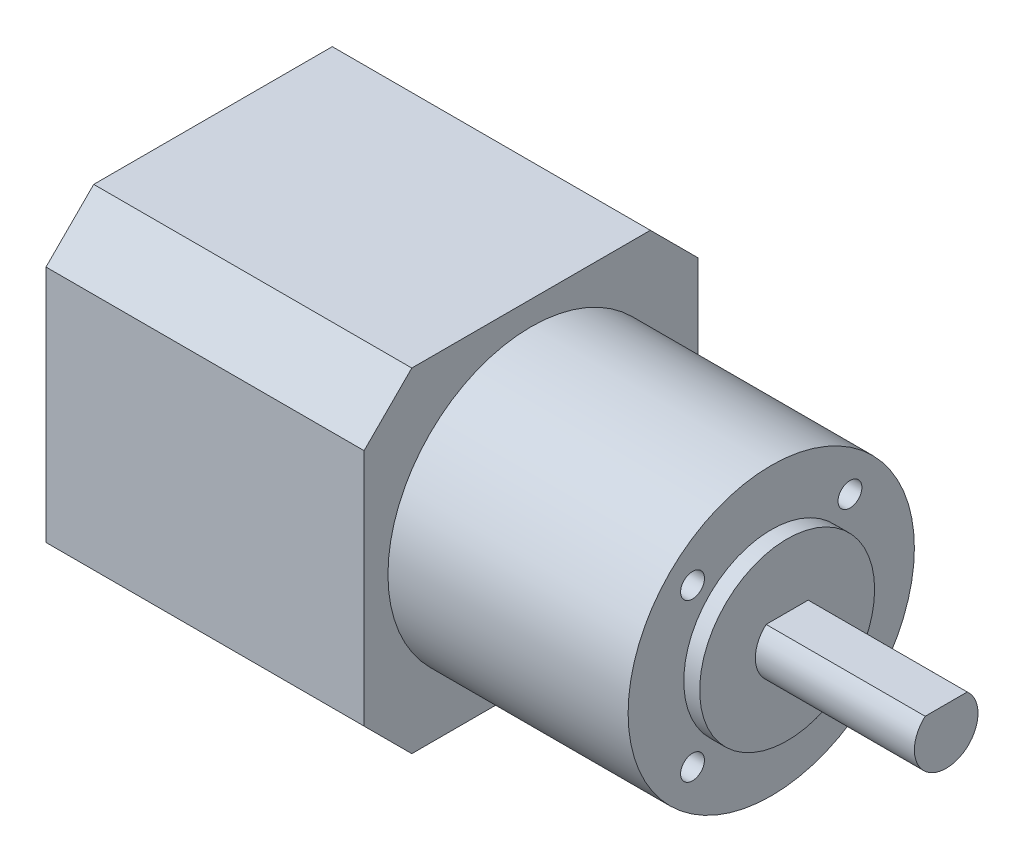
ISO-10303-21;
HEADER;
FILE_DESCRIPTION(('STEP AP214'),'2;1');
FILE_NAME('part.step','',(''),(''),'','','');
FILE_SCHEMA(('AUTOMOTIVE_DESIGN { 1 0 10303 214 1 1 1 1 }'));
ENDSEC;
DATA;
#1=APPLICATION_CONTEXT('core data for automotive mechanical design processes');
#2=APPLICATION_PROTOCOL_DEFINITION('international standard','automotive_design',2000,#1);
#3=PRODUCT_CONTEXT('',#1,'mechanical');
#4=PRODUCT('Part','Part','',(#3));
#5=PRODUCT_RELATED_PRODUCT_CATEGORY('part','',(#4));
#6=PRODUCT_DEFINITION_FORMATION('','',#4);
#7=PRODUCT_DEFINITION_CONTEXT('part definition',#1,'design');
#8=PRODUCT_DEFINITION('design','',#6,#7);
#9=PRODUCT_DEFINITION_SHAPE('','',#8);
#10=(LENGTH_UNIT() NAMED_UNIT(*) SI_UNIT(.MILLI.,.METRE.));
#11=(NAMED_UNIT(*) PLANE_ANGLE_UNIT() SI_UNIT($,.RADIAN.));
#12=(NAMED_UNIT(*) SI_UNIT($,.STERADIAN.) SOLID_ANGLE_UNIT());
#13=UNCERTAINTY_MEASURE_WITH_UNIT(LENGTH_MEASURE(1.E-05),#10,'distance_accuracy_value','');
#14=(GEOMETRIC_REPRESENTATION_CONTEXT(3) GLOBAL_UNCERTAINTY_ASSIGNED_CONTEXT((#13)) GLOBAL_UNIT_ASSIGNED_CONTEXT((#10,
#11,#12)) REPRESENTATION_CONTEXT('',''));
#15=CARTESIAN_POINT('',(0.,0.,0.));
#16=DIRECTION('',(0.,0.,1.));
#17=DIRECTION('',(1.,0.,0.));
#18=AXIS2_PLACEMENT_3D('',#15,#16,#17);
#19=CARTESIAN_POINT('',(72.2,0.,0.));
#20=DIRECTION('',(1.,0.,0.));
#21=DIRECTION('',(0.,0.,-1.));
#22=AXIS2_PLACEMENT_3D('',#19,#20,#21);
#23=PLANE('',#22);
#24=CARTESIAN_POINT('',(72.2,0.,0.));
#25=DIRECTION('',(1.,0.,0.));
#26=DIRECTION('',(0.,0.,-1.));
#27=AXIS2_PLACEMENT_3D('',#24,#25,#26);
#28=CIRCLE('',#27,11.);
#29=CARTESIAN_POINT('',(72.2,0.,-11.));
#30=VERTEX_POINT('',#29);
#31=EDGE_CURVE('E222',#30,#30,#28,.T.);
#32=ORIENTED_EDGE('',*,*,#31,.T.);
#33=EDGE_LOOP('',(#32));
#34=FACE_BOUND('',#33,.T.);
#35=DIRECTION('',(0.,0.,1.));
#36=VECTOR('',#35,1.);
#37=CARTESIAN_POINT('',(72.2,3.,-2.64575131106459));
#38=LINE('',#37,#36);
#39=CARTESIAN_POINT('',(72.2,3.,-2.64575131106459));
#40=VERTEX_POINT('',#39);
#41=CARTESIAN_POINT('',(72.2,3.,2.64575131106459));
#42=VERTEX_POINT('',#41);
#43=EDGE_CURVE('E235',#40,#42,#38,.T.);
#44=ORIENTED_EDGE('',*,*,#43,.F.);
#45=CARTESIAN_POINT('',(72.2,0.,0.));
#46=DIRECTION('',(1.,0.,0.));
#47=DIRECTION('',(0.,0.,-1.));
#48=AXIS2_PLACEMENT_3D('',#45,#46,#47);
#49=CIRCLE('',#48,4.);
#50=EDGE_CURVE('E49',#42,#40,#49,.T.);
#51=ORIENTED_EDGE('',*,*,#50,.F.);
#52=EDGE_LOOP('',(#44,#51));
#53=FACE_BOUND('',#52,.T.);
#54=ADVANCED_FACE('F34',(#34,#53),#23,.T.);
#55=CARTESIAN_POINT('',(70.2,0.,0.));
#56=DIRECTION('',(1.,0.,0.));
#57=DIRECTION('',(0.,0.,-1.));
#58=AXIS2_PLACEMENT_3D('',#55,#56,#57);
#59=PLANE('',#58);
#60=CARTESIAN_POINT('',(70.2,-9.89949493661157,9.89949493661177));
#61=DIRECTION('',(1.,0.,0.));
#62=DIRECTION('',(0.,0.,-1.));
#63=AXIS2_PLACEMENT_3D('',#60,#61,#62);
#64=CIRCLE('',#63,1.5);
#65=CARTESIAN_POINT('',(70.2,-9.89949493661157,8.39949493661177));
#66=VERTEX_POINT('',#65);
#67=EDGE_CURVE('E216',#66,#66,#64,.T.);
#68=ORIENTED_EDGE('',*,*,#67,.F.);
#69=EDGE_LOOP('',(#68));
#70=FACE_BOUND('',#69,.T.);
#71=CARTESIAN_POINT('',(70.2,9.89949493661164,-9.8994949366117));
#72=DIRECTION('',(1.,0.,0.));
#73=DIRECTION('',(0.,0.,-1.));
#74=AXIS2_PLACEMENT_3D('',#71,#72,#73);
#75=CIRCLE('',#74,1.5);
#76=CARTESIAN_POINT('',(70.2,9.89949493661164,-11.3994949366117));
#77=VERTEX_POINT('',#76);
#78=EDGE_CURVE('E204',#77,#77,#75,.T.);
#79=ORIENTED_EDGE('',*,*,#78,.F.);
#80=EDGE_LOOP('',(#79));
#81=FACE_BOUND('',#80,.T.);
#82=CARTESIAN_POINT('',(70.2,0.,0.));
#83=DIRECTION('',(1.,0.,0.));
#84=DIRECTION('',(0.,0.,-1.));
#85=AXIS2_PLACEMENT_3D('',#82,#83,#84);
#86=CIRCLE('',#85,18.);
#87=CARTESIAN_POINT('',(70.2,0.,-18.));
#88=VERTEX_POINT('',#87);
#89=EDGE_CURVE('E149',#88,#88,#86,.T.);
#90=ORIENTED_EDGE('',*,*,#89,.T.);
#91=EDGE_LOOP('',(#90));
#92=FACE_BOUND('',#91,.T.);
#93=CARTESIAN_POINT('',(70.2,9.89949493661166,9.89949493661167));
#94=DIRECTION('',(1.,0.,0.));
#95=DIRECTION('',(0.,0.,-1.));
#96=AXIS2_PLACEMENT_3D('',#93,#94,#95);
#97=CIRCLE('',#96,1.5);
#98=CARTESIAN_POINT('',(70.2,9.89949493661166,8.39949493661167));
#99=VERTEX_POINT('',#98);
#100=EDGE_CURVE('E200',#99,#99,#97,.T.);
#101=ORIENTED_EDGE('',*,*,#100,.F.);
#102=EDGE_LOOP('',(#101));
#103=FACE_BOUND('',#102,.T.);
#104=CARTESIAN_POINT('',(70.2,-9.89949493661173,-9.8994949366116));
#105=DIRECTION('',(1.,0.,0.));
#106=DIRECTION('',(0.,0.,-1.));
#107=AXIS2_PLACEMENT_3D('',#104,#105,#106);
#108=CIRCLE('',#107,1.5);
#109=CARTESIAN_POINT('',(70.2,-9.89949493661173,-11.3994949366116));
#110=VERTEX_POINT('',#109);
#111=EDGE_CURVE('E210',#110,#110,#108,.T.);
#112=ORIENTED_EDGE('',*,*,#111,.F.);
#113=EDGE_LOOP('',(#112));
#114=FACE_BOUND('',#113,.T.);
#115=CARTESIAN_POINT('',(70.2,0.,0.));
#116=DIRECTION('',(1.,0.,0.));
#117=DIRECTION('',(0.,0.,-1.));
#118=AXIS2_PLACEMENT_3D('',#115,#116,#117);
#119=CIRCLE('',#118,11.);
#120=CARTESIAN_POINT('',(70.2,0.,-11.));
#121=VERTEX_POINT('',#120);
#122=EDGE_CURVE('E225',#121,#121,#119,.T.);
#123=ORIENTED_EDGE('',*,*,#122,.F.);
#124=EDGE_LOOP('',(#123));
#125=FACE_BOUND('',#124,.T.);
#126=ADVANCED_FACE('F256',(#70,#81,#92,#103,#114,#125),#59,.T.);
#127=CARTESIAN_POINT('',(40.,21.,21.));
#128=DIRECTION('',(-1.,0.,0.));
#129=DIRECTION('',(0.,0.,1.));
#130=AXIS2_PLACEMENT_3D('',#127,#128,#129);
#131=PLANE('',#130);
#132=DIRECTION('',(0.,-1.,0.));
#133=VECTOR('',#132,1.);
#134=CARTESIAN_POINT('',(40.,-15.,21.));
#135=LINE('',#134,#133);
#136=CARTESIAN_POINT('',(40.,15.,21.));
#137=VERTEX_POINT('',#136);
#138=CARTESIAN_POINT('',(40.,-15.,21.));
#139=VERTEX_POINT('',#138);
#140=EDGE_CURVE('E161',#137,#139,#135,.T.);
#141=ORIENTED_EDGE('',*,*,#140,.T.);
#142=DIRECTION('',(0.,-0.707106781186548,-0.707106781186548));
#143=VECTOR('',#142,1.);
#144=CARTESIAN_POINT('',(40.,-15.,21.));
#145=LINE('',#144,#143);
#146=CARTESIAN_POINT('',(40.,-21.,15.));
#147=VERTEX_POINT('',#146);
#148=EDGE_CURVE('E100',#139,#147,#145,.T.);
#149=ORIENTED_EDGE('',*,*,#148,.T.);
#150=DIRECTION('',(0.,0.,-1.));
#151=VECTOR('',#150,1.);
#152=CARTESIAN_POINT('',(40.,-21.,15.));
#153=LINE('',#152,#151);
#154=CARTESIAN_POINT('',(40.,-21.,-15.));
#155=VERTEX_POINT('',#154);
#156=EDGE_CURVE('E192',#147,#155,#153,.T.);
#157=ORIENTED_EDGE('',*,*,#156,.T.);
#158=DIRECTION('',(0.,0.707106781186548,-0.707106781186547));
#159=VECTOR('',#158,1.);
#160=CARTESIAN_POINT('',(40.,-21.,-15.));
#161=LINE('',#160,#159);
#162=CARTESIAN_POINT('',(40.,-15.,-21.));
#163=VERTEX_POINT('',#162);
#164=EDGE_CURVE('E191',#155,#163,#161,.T.);
#165=ORIENTED_EDGE('',*,*,#164,.T.);
#166=DIRECTION('',(0.,1.,0.));
#167=VECTOR('',#166,1.);
#168=CARTESIAN_POINT('',(40.,-15.,-21.));
#169=LINE('',#168,#167);
#170=CARTESIAN_POINT('',(40.,15.,-21.));
#171=VERTEX_POINT('',#170);
#172=EDGE_CURVE('E124',#163,#171,#169,.T.);
#173=ORIENTED_EDGE('',*,*,#172,.T.);
#174=DIRECTION('',(0.,0.707106781186548,0.707106781186548));
#175=VECTOR('',#174,1.);
#176=CARTESIAN_POINT('',(40.,21.,-15.));
#177=LINE('',#176,#175);
#178=CARTESIAN_POINT('',(40.,21.,-15.));
#179=VERTEX_POINT('',#178);
#180=EDGE_CURVE('E116',#171,#179,#177,.T.);
#181=ORIENTED_EDGE('',*,*,#180,.T.);
#182=DIRECTION('',(0.,0.,1.));
#183=VECTOR('',#182,1.);
#184=CARTESIAN_POINT('',(40.,21.,15.));
#185=LINE('',#184,#183);
#186=CARTESIAN_POINT('',(40.,21.,15.));
#187=VERTEX_POINT('',#186);
#188=EDGE_CURVE('E121',#179,#187,#185,.T.);
#189=ORIENTED_EDGE('',*,*,#188,.T.);
#190=DIRECTION('',(0.,-0.707106781186548,0.707106781186548));
#191=VECTOR('',#190,1.);
#192=CARTESIAN_POINT('',(40.,15.,21.));
#193=LINE('',#192,#191);
#194=EDGE_CURVE('E58',#187,#137,#193,.T.);
#195=ORIENTED_EDGE('',*,*,#194,.T.);
#196=EDGE_LOOP('',(#141,#149,#157,#165,#173,#181,#189,#195));
#197=FACE_BOUND('',#196,.T.);
#198=CARTESIAN_POINT('',(40.,0.,0.));
#199=DIRECTION('',(-1.,0.,0.));
#200=DIRECTION('',(0.,0.,1.));
#201=AXIS2_PLACEMENT_3D('',#198,#199,#200);
#202=CIRCLE('',#201,18.);
#203=CARTESIAN_POINT('',(40.,0.,18.));
#204=VERTEX_POINT('',#203);
#205=EDGE_CURVE('E11',#204,#204,#202,.F.);
#206=ORIENTED_EDGE('',*,*,#205,.F.);
#207=EDGE_LOOP('',(#206));
#208=FACE_BOUND('',#207,.T.);
#209=ADVANCED_FACE('F118',(#197,#208),#131,.F.);
#210=CARTESIAN_POINT('',(40.,-15.,21.));
#211=DIRECTION('',(0.,0.,-1.));
#212=DIRECTION('',(-1.,0.,0.));
#213=AXIS2_PLACEMENT_3D('',#210,#211,#212);
#214=PLANE('',#213);
#215=DIRECTION('',(0.,-1.,0.));
#216=VECTOR('',#215,1.);
#217=CARTESIAN_POINT('',(0.,-15.,21.));
#218=LINE('',#217,#216);
#219=CARTESIAN_POINT('',(0.,15.,21.));
#220=VERTEX_POINT('',#219);
#221=CARTESIAN_POINT('',(0.,-15.,21.));
#222=VERTEX_POINT('',#221);
#223=EDGE_CURVE('E145',#220,#222,#218,.T.);
#224=ORIENTED_EDGE('',*,*,#223,.T.);
#225=DIRECTION('',(-1.,0.,0.));
#226=VECTOR('',#225,1.);
#227=CARTESIAN_POINT('',(40.,-15.,21.));
#228=LINE('',#227,#226);
#229=EDGE_CURVE('E42',#139,#222,#228,.T.);
#230=ORIENTED_EDGE('',*,*,#229,.F.);
#231=ORIENTED_EDGE('',*,*,#140,.F.);
#232=DIRECTION('',(-1.,0.,0.));
#233=VECTOR('',#232,1.);
#234=CARTESIAN_POINT('',(40.,15.,21.));
#235=LINE('',#234,#233);
#236=EDGE_CURVE('E141',#137,#220,#235,.T.);
#237=ORIENTED_EDGE('',*,*,#236,.T.);
#238=EDGE_LOOP('',(#224,#230,#231,#237));
#239=FACE_BOUND('',#238,.T.);
#240=ADVANCED_FACE('F36',(#239),#214,.F.);
#241=CARTESIAN_POINT('',(40.,-15.,21.));
#242=DIRECTION('',(0.,0.707106781186548,-0.707106781186548));
#243=DIRECTION('',(0.,0.707106781186548,0.707106781186548));
#244=AXIS2_PLACEMENT_3D('',#241,#242,#243);
#245=PLANE('',#244);
#246=DIRECTION('',(0.,-0.707106781186548,-0.707106781186548));
#247=VECTOR('',#246,1.);
#248=CARTESIAN_POINT('',(0.,-15.,21.));
#249=LINE('',#248,#247);
#250=CARTESIAN_POINT('',(0.,-21.,15.));
#251=VERTEX_POINT('',#250);
#252=EDGE_CURVE('E148',#222,#251,#249,.T.);
#253=ORIENTED_EDGE('',*,*,#252,.T.);
#254=DIRECTION('',(-1.,0.,0.));
#255=VECTOR('',#254,1.);
#256=CARTESIAN_POINT('',(40.,-21.,15.));
#257=LINE('',#256,#255);
#258=EDGE_CURVE('E171',#147,#251,#257,.T.);
#259=ORIENTED_EDGE('',*,*,#258,.F.);
#260=ORIENTED_EDGE('',*,*,#148,.F.);
#261=ORIENTED_EDGE('',*,*,#229,.T.);
#262=EDGE_LOOP('',(#253,#259,#260,#261));
#263=FACE_BOUND('',#262,.T.);
#264=ADVANCED_FACE('F174',(#263),#245,.F.);
#265=CARTESIAN_POINT('',(40.,-21.,15.));
#266=DIRECTION('',(0.,1.,0.));
#267=DIRECTION('',(0.,0.,1.));
#268=AXIS2_PLACEMENT_3D('',#265,#266,#267);
#269=PLANE('',#268);
#270=DIRECTION('',(0.,0.,-1.));
#271=VECTOR('',#270,1.);
#272=CARTESIAN_POINT('',(0.,-21.,15.));
#273=LINE('',#272,#271);
#274=CARTESIAN_POINT('',(0.,-21.,-15.));
#275=VERTEX_POINT('',#274);
#276=EDGE_CURVE('E151',#251,#275,#273,.T.);
#277=ORIENTED_EDGE('',*,*,#276,.T.);
#278=DIRECTION('',(-1.,0.,0.));
#279=VECTOR('',#278,1.);
#280=CARTESIAN_POINT('',(40.,-21.,-15.));
#281=LINE('',#280,#279);
#282=EDGE_CURVE('E168',#155,#275,#281,.T.);
#283=ORIENTED_EDGE('',*,*,#282,.F.);
#284=ORIENTED_EDGE('',*,*,#156,.F.);
#285=ORIENTED_EDGE('',*,*,#258,.T.);
#286=EDGE_LOOP('',(#277,#283,#284,#285));
#287=FACE_BOUND('',#286,.T.);
#288=ADVANCED_FACE('F185',(#287),#269,.F.);
#289=CARTESIAN_POINT('',(40.,-21.,-15.));
#290=DIRECTION('',(0.,0.707106781186547,0.707106781186548));
#291=DIRECTION('',(0.,-0.707106781186548,0.707106781186547));
#292=AXIS2_PLACEMENT_3D('',#289,#290,#291);
#293=PLANE('',#292);
#294=DIRECTION('',(0.,0.707106781186548,-0.707106781186547));
#295=VECTOR('',#294,1.);
#296=CARTESIAN_POINT('',(0.,-21.,-15.));
#297=LINE('',#296,#295);
#298=CARTESIAN_POINT('',(0.,-15.,-21.));
#299=VERTEX_POINT('',#298);
#300=EDGE_CURVE('E153',#275,#299,#297,.T.);
#301=ORIENTED_EDGE('',*,*,#300,.T.);
#302=DIRECTION('',(-1.,0.,0.));
#303=VECTOR('',#302,1.);
#304=CARTESIAN_POINT('',(40.,-15.,-21.));
#305=LINE('',#304,#303);
#306=EDGE_CURVE('E165',#163,#299,#305,.T.);
#307=ORIENTED_EDGE('',*,*,#306,.F.);
#308=ORIENTED_EDGE('',*,*,#164,.F.);
#309=ORIENTED_EDGE('',*,*,#282,.T.);
#310=EDGE_LOOP('',(#301,#307,#308,#309));
#311=FACE_BOUND('',#310,.T.);
#312=ADVANCED_FACE('F189',(#311),#293,.F.);
#313=CARTESIAN_POINT('',(40.,-15.,-21.));
#314=DIRECTION('',(0.,0.,1.));
#315=DIRECTION('',(1.,0.,0.));
#316=AXIS2_PLACEMENT_3D('',#313,#314,#315);
#317=PLANE('',#316);
#318=DIRECTION('',(0.,1.,0.));
#319=VECTOR('',#318,1.);
#320=CARTESIAN_POINT('',(0.,-15.,-21.));
#321=LINE('',#320,#319);
#322=CARTESIAN_POINT('',(0.,15.,-21.));
#323=VERTEX_POINT('',#322);
#324=EDGE_CURVE('E155',#299,#323,#321,.T.);
#325=ORIENTED_EDGE('',*,*,#324,.T.);
#326=DIRECTION('',(-1.,0.,0.));
#327=VECTOR('',#326,1.);
#328=CARTESIAN_POINT('',(40.,15.,-21.));
#329=LINE('',#328,#327);
#330=EDGE_CURVE('E136',#171,#323,#329,.T.);
#331=ORIENTED_EDGE('',*,*,#330,.F.);
#332=ORIENTED_EDGE('',*,*,#172,.F.);
#333=ORIENTED_EDGE('',*,*,#306,.T.);
#334=EDGE_LOOP('',(#325,#331,#332,#333));
#335=FACE_BOUND('',#334,.T.);
#336=ADVANCED_FACE('F306',(#335),#317,.F.);
#337=CARTESIAN_POINT('',(40.,21.,-15.));
#338=DIRECTION('',(0.,-0.707106781186548,0.707106781186548));
#339=DIRECTION('',(0.,-0.707106781186548,-0.707106781186548));
#340=AXIS2_PLACEMENT_3D('',#337,#338,#339);
#341=PLANE('',#340);
#342=DIRECTION('',(0.,0.707106781186548,0.707106781186548));
#343=VECTOR('',#342,1.);
#344=CARTESIAN_POINT('',(0.,21.,-15.));
#345=LINE('',#344,#343);
#346=CARTESIAN_POINT('',(0.,21.,-15.));
#347=VERTEX_POINT('',#346);
#348=EDGE_CURVE('E133',#323,#347,#345,.T.);
#349=ORIENTED_EDGE('',*,*,#348,.T.);
#350=DIRECTION('',(-1.,0.,0.));
#351=VECTOR('',#350,1.);
#352=CARTESIAN_POINT('',(40.,21.,-15.));
#353=LINE('',#352,#351);
#354=EDGE_CURVE('E130',#179,#347,#353,.T.);
#355=ORIENTED_EDGE('',*,*,#354,.F.);
#356=ORIENTED_EDGE('',*,*,#180,.F.);
#357=ORIENTED_EDGE('',*,*,#330,.T.);
#358=EDGE_LOOP('',(#349,#355,#356,#357));
#359=FACE_BOUND('',#358,.T.);
#360=ADVANCED_FACE('F131',(#359),#341,.F.);
#361=CARTESIAN_POINT('',(40.,21.,15.));
#362=DIRECTION('',(0.,-1.,0.));
#363=DIRECTION('',(0.,0.,-1.));
#364=AXIS2_PLACEMENT_3D('',#361,#362,#363);
#365=PLANE('',#364);
#366=DIRECTION('',(0.,0.,1.));
#367=VECTOR('',#366,1.);
#368=CARTESIAN_POINT('',(0.,21.,15.));
#369=LINE('',#368,#367);
#370=CARTESIAN_POINT('',(0.,21.,15.));
#371=VERTEX_POINT('',#370);
#372=EDGE_CURVE('E158',#347,#371,#369,.T.);
#373=ORIENTED_EDGE('',*,*,#372,.T.);
#374=DIRECTION('',(-1.,0.,0.));
#375=VECTOR('',#374,1.);
#376=CARTESIAN_POINT('',(40.,21.,15.));
#377=LINE('',#376,#375);
#378=EDGE_CURVE('E137',#187,#371,#377,.T.);
#379=ORIENTED_EDGE('',*,*,#378,.F.);
#380=ORIENTED_EDGE('',*,*,#188,.F.);
#381=ORIENTED_EDGE('',*,*,#354,.T.);
#382=EDGE_LOOP('',(#373,#379,#380,#381));
#383=FACE_BOUND('',#382,.T.);
#384=ADVANCED_FACE('F139',(#383),#365,.F.);
#385=CARTESIAN_POINT('',(40.,15.,21.));
#386=DIRECTION('',(0.,-0.707106781186548,-0.707106781186548));
#387=DIRECTION('',(0.,0.707106781186548,-0.707106781186548));
#388=AXIS2_PLACEMENT_3D('',#385,#386,#387);
#389=PLANE('',#388);
#390=DIRECTION('',(0.,-0.707106781186548,0.707106781186548));
#391=VECTOR('',#390,1.);
#392=CARTESIAN_POINT('',(0.,15.,21.));
#393=LINE('',#392,#391);
#394=EDGE_CURVE('E91',#371,#220,#393,.T.);
#395=ORIENTED_EDGE('',*,*,#394,.T.);
#396=ORIENTED_EDGE('',*,*,#236,.F.);
#397=ORIENTED_EDGE('',*,*,#194,.F.);
#398=ORIENTED_EDGE('',*,*,#378,.T.);
#399=EDGE_LOOP('',(#395,#396,#397,#398));
#400=FACE_BOUND('',#399,.T.);
#401=ADVANCED_FACE('F299',(#400),#389,.F.);
#402=CARTESIAN_POINT('',(0.,21.,21.));
#403=DIRECTION('',(-1.,0.,0.));
#404=DIRECTION('',(0.,0.,1.));
#405=AXIS2_PLACEMENT_3D('',#402,#403,#404);
#406=PLANE('',#405);
#407=ORIENTED_EDGE('',*,*,#223,.F.);
#408=ORIENTED_EDGE('',*,*,#394,.F.);
#409=ORIENTED_EDGE('',*,*,#372,.F.);
#410=ORIENTED_EDGE('',*,*,#348,.F.);
#411=ORIENTED_EDGE('',*,*,#324,.F.);
#412=ORIENTED_EDGE('',*,*,#300,.F.);
#413=ORIENTED_EDGE('',*,*,#276,.F.);
#414=ORIENTED_EDGE('',*,*,#252,.F.);
#415=EDGE_LOOP('',(#407,#408,#409,#410,#411,#412,#413,#414));
#416=FACE_BOUND('',#415,.T.);
#417=ADVANCED_FACE('F179',(#416),#406,.T.);
#418=CARTESIAN_POINT('',(70.2,0.,0.));
#419=DIRECTION('',(-1.,0.,0.));
#420=DIRECTION('',(0.,0.,1.));
#421=AXIS2_PLACEMENT_3D('',#418,#419,#420);
#422=CYLINDRICAL_SURFACE('',#421,18.);
#423=ORIENTED_EDGE('',*,*,#89,.F.);
#424=EDGE_LOOP('',(#423));
#425=FACE_BOUND('',#424,.T.);
#426=ORIENTED_EDGE('',*,*,#205,.T.);
#427=EDGE_LOOP('',(#426));
#428=FACE_BOUND('',#427,.T.);
#429=ADVANCED_FACE('F287',(#425,#428),#422,.T.);
#430=CARTESIAN_POINT('',(70.2,9.89949493661166,9.89949493661167));
#431=DIRECTION('',(-1.,0.,0.));
#432=DIRECTION('',(0.,0.,1.));
#433=AXIS2_PLACEMENT_3D('',#430,#431,#432);
#434=CYLINDRICAL_SURFACE('',#433,1.5);
#435=ORIENTED_EDGE('',*,*,#100,.T.);
#436=EDGE_LOOP('',(#435));
#437=FACE_BOUND('',#436,.T.);
#438=CARTESIAN_POINT('',(40.,9.89949493661166,9.89949493661167));
#439=DIRECTION('',(1.,0.,0.));
#440=DIRECTION('',(0.,0.,-1.));
#441=AXIS2_PLACEMENT_3D('',#438,#439,#440);
#442=CIRCLE('',#441,1.5);
#443=CARTESIAN_POINT('',(40.,9.89949493661166,8.39949493661167));
#444=VERTEX_POINT('',#443);
#445=EDGE_CURVE('E201',#444,#444,#442,.T.);
#446=ORIENTED_EDGE('',*,*,#445,.F.);
#447=EDGE_LOOP('',(#446));
#448=FACE_BOUND('',#447,.T.);
#449=ADVANCED_FACE('F284',(#437,#448),#434,.F.);
#450=CARTESIAN_POINT('',(70.2,9.89949493661164,-9.8994949366117));
#451=DIRECTION('',(-1.,0.,0.));
#452=DIRECTION('',(0.,0.,1.));
#453=AXIS2_PLACEMENT_3D('',#450,#451,#452);
#454=CYLINDRICAL_SURFACE('',#453,1.5);
#455=ORIENTED_EDGE('',*,*,#78,.T.);
#456=EDGE_LOOP('',(#455));
#457=FACE_BOUND('',#456,.T.);
#458=CARTESIAN_POINT('',(40.,9.89949493661164,-9.8994949366117));
#459=DIRECTION('',(1.,0.,0.));
#460=DIRECTION('',(0.,0.,-1.));
#461=AXIS2_PLACEMENT_3D('',#458,#459,#460);
#462=CIRCLE('',#461,1.5);
#463=CARTESIAN_POINT('',(40.,9.89949493661164,-11.3994949366117));
#464=VERTEX_POINT('',#463);
#465=EDGE_CURVE('E207',#464,#464,#462,.T.);
#466=ORIENTED_EDGE('',*,*,#465,.F.);
#467=EDGE_LOOP('',(#466));
#468=FACE_BOUND('',#467,.T.);
#469=ADVANCED_FACE('F280',(#457,#468),#454,.F.);
#470=CARTESIAN_POINT('',(70.2,-9.89949493661173,-9.8994949366116));
#471=DIRECTION('',(-1.,0.,0.));
#472=DIRECTION('',(0.,0.,1.));
#473=AXIS2_PLACEMENT_3D('',#470,#471,#472);
#474=CYLINDRICAL_SURFACE('',#473,1.5);
#475=ORIENTED_EDGE('',*,*,#111,.T.);
#476=EDGE_LOOP('',(#475));
#477=FACE_BOUND('',#476,.T.);
#478=CARTESIAN_POINT('',(40.,-9.89949493661173,-9.8994949366116));
#479=DIRECTION('',(1.,0.,0.));
#480=DIRECTION('',(0.,0.,-1.));
#481=AXIS2_PLACEMENT_3D('',#478,#479,#480);
#482=CIRCLE('',#481,1.5);
#483=CARTESIAN_POINT('',(40.,-9.89949493661173,-11.3994949366116));
#484=VERTEX_POINT('',#483);
#485=EDGE_CURVE('E213',#484,#484,#482,.T.);
#486=ORIENTED_EDGE('',*,*,#485,.F.);
#487=EDGE_LOOP('',(#486));
#488=FACE_BOUND('',#487,.T.);
#489=ADVANCED_FACE('F276',(#477,#488),#474,.F.);
#490=CARTESIAN_POINT('',(70.2,-9.89949493661157,9.89949493661177));
#491=DIRECTION('',(-1.,0.,0.));
#492=DIRECTION('',(0.,0.,1.));
#493=AXIS2_PLACEMENT_3D('',#490,#491,#492);
#494=CYLINDRICAL_SURFACE('',#493,1.5);
#495=ORIENTED_EDGE('',*,*,#67,.T.);
#496=EDGE_LOOP('',(#495));
#497=FACE_BOUND('',#496,.T.);
#498=CARTESIAN_POINT('',(40.,-9.89949493661157,9.89949493661177));
#499=DIRECTION('',(1.,0.,0.));
#500=DIRECTION('',(0.,0.,-1.));
#501=AXIS2_PLACEMENT_3D('',#498,#499,#500);
#502=CIRCLE('',#501,1.5);
#503=CARTESIAN_POINT('',(40.,-9.89949493661157,8.39949493661177));
#504=VERTEX_POINT('',#503);
#505=EDGE_CURVE('E219',#504,#504,#502,.T.);
#506=ORIENTED_EDGE('',*,*,#505,.F.);
#507=EDGE_LOOP('',(#506));
#508=FACE_BOUND('',#507,.T.);
#509=ADVANCED_FACE('F272',(#497,#508),#494,.F.);
#510=ORIENTED_EDGE('',*,*,#485,.T.);
#511=EDGE_LOOP('',(#510));
#512=FACE_BOUND('',#511,.T.);
#513=ADVANCED_FACE('F275',(#512),#131,.F.);
#514=ORIENTED_EDGE('',*,*,#465,.T.);
#515=EDGE_LOOP('',(#514));
#516=FACE_BOUND('',#515,.T.);
#517=ADVANCED_FACE('F323',(#516),#131,.F.);
#518=ORIENTED_EDGE('',*,*,#445,.T.);
#519=EDGE_LOOP('',(#518));
#520=FACE_BOUND('',#519,.T.);
#521=ADVANCED_FACE('F295',(#520),#131,.F.);
#522=ORIENTED_EDGE('',*,*,#505,.T.);
#523=EDGE_LOOP('',(#522));
#524=FACE_BOUND('',#523,.T.);
#525=ADVANCED_FACE('F270',(#524),#131,.F.);
#526=CARTESIAN_POINT('',(72.2,0.,0.));
#527=DIRECTION('',(-1.,0.,0.));
#528=DIRECTION('',(0.,0.,1.));
#529=AXIS2_PLACEMENT_3D('',#526,#527,#528);
#530=CYLINDRICAL_SURFACE('',#529,11.);
#531=ORIENTED_EDGE('',*,*,#31,.F.);
#532=EDGE_LOOP('',(#531));
#533=FACE_BOUND('',#532,.T.);
#534=ORIENTED_EDGE('',*,*,#122,.T.);
#535=EDGE_LOOP('',(#534));
#536=FACE_BOUND('',#535,.T.);
#537=ADVANCED_FACE('F267',(#533,#536),#530,.T.);
#538=CARTESIAN_POINT('',(92.2,0.,0.));
#539=DIRECTION('',(-1.,0.,0.));
#540=DIRECTION('',(0.,0.,1.));
#541=AXIS2_PLACEMENT_3D('',#538,#539,#540);
#542=CYLINDRICAL_SURFACE('',#541,4.);
#543=ORIENTED_EDGE('',*,*,#50,.T.);
#544=DIRECTION('',(-1.,0.,0.));
#545=VECTOR('',#544,1.);
#546=CARTESIAN_POINT('',(92.2,3.,-2.64575131106459));
#547=LINE('',#546,#545);
#548=CARTESIAN_POINT('',(92.2,3.,-2.64575131106459));
#549=VERTEX_POINT('',#548);
#550=EDGE_CURVE('E228',#549,#40,#547,.T.);
#551=ORIENTED_EDGE('',*,*,#550,.F.);
#552=CARTESIAN_POINT('',(92.2,0.,0.));
#553=DIRECTION('',(1.,0.,0.));
#554=DIRECTION('',(0.,0.,-1.));
#555=AXIS2_PLACEMENT_3D('',#552,#553,#554);
#556=CIRCLE('',#555,4.);
#557=CARTESIAN_POINT('',(92.2,3.,2.64575131106459));
#558=VERTEX_POINT('',#557);
#559=EDGE_CURVE('E238',#558,#549,#556,.T.);
#560=ORIENTED_EDGE('',*,*,#559,.F.);
#561=DIRECTION('',(-1.,0.,0.));
#562=VECTOR('',#561,1.);
#563=CARTESIAN_POINT('',(92.2,3.,2.64575131106459));
#564=LINE('',#563,#562);
#565=EDGE_CURVE('E232',#558,#42,#564,.T.);
#566=ORIENTED_EDGE('',*,*,#565,.T.);
#567=EDGE_LOOP('',(#543,#551,#560,#566));
#568=FACE_BOUND('',#567,.T.);
#569=ADVANCED_FACE('F250',(#568),#542,.T.);
#570=CARTESIAN_POINT('',(92.2,3.,-2.64575131106459));
#571=DIRECTION('',(0.,-1.,0.));
#572=DIRECTION('',(0.,0.,-1.));
#573=AXIS2_PLACEMENT_3D('',#570,#571,#572);
#574=PLANE('',#573);
#575=ORIENTED_EDGE('',*,*,#43,.T.);
#576=ORIENTED_EDGE('',*,*,#565,.F.);
#577=DIRECTION('',(0.,0.,1.));
#578=VECTOR('',#577,1.);
#579=CARTESIAN_POINT('',(92.2,3.,-2.64575131106459));
#580=LINE('',#579,#578);
#581=EDGE_CURVE('E234',#549,#558,#580,.T.);
#582=ORIENTED_EDGE('',*,*,#581,.F.);
#583=ORIENTED_EDGE('',*,*,#550,.T.);
#584=EDGE_LOOP('',(#575,#576,#582,#583));
#585=FACE_BOUND('',#584,.T.);
#586=ADVANCED_FACE('F253',(#585),#574,.F.);
#587=CARTESIAN_POINT('',(92.2,0.,0.));
#588=DIRECTION('',(1.,0.,0.));
#589=DIRECTION('',(0.,0.,-1.));
#590=AXIS2_PLACEMENT_3D('',#587,#588,#589);
#591=PLANE('',#590);
#592=ORIENTED_EDGE('',*,*,#559,.T.);
#593=ORIENTED_EDGE('',*,*,#581,.T.);
#594=EDGE_LOOP('',(#592,#593));
#595=FACE_BOUND('',#594,.T.);
#596=ADVANCED_FACE('F246',(#595),#591,.T.);
#597=CLOSED_SHELL('',(#54,#126,#209,#240,#264,#288,#312,#336,#360,#384,#401,#417,#429,#449,#469,
#489,#509,#513,#517,#521,#525,#537,#569,#586,#596));
#598=MANIFOLD_SOLID_BREP('B2',#597);
#599=ADVANCED_BREP_SHAPE_REPRESENTATION('',(#18,#598),#14);
#600=SHAPE_DEFINITION_REPRESENTATION(#9,#599);
ENDSEC;
END-ISO-10303-21;
